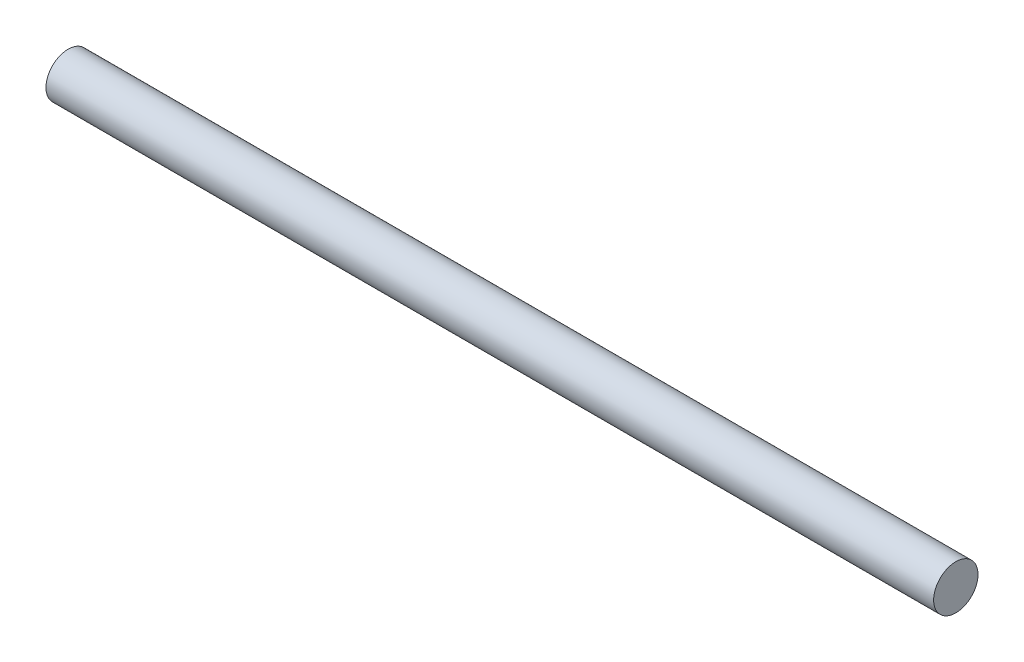
ISO-10303-21;
HEADER;
FILE_DESCRIPTION(('STEP AP214'),'2;1');
FILE_NAME('part.step','',(''),(''),'','','');
FILE_SCHEMA(('AUTOMOTIVE_DESIGN { 1 0 10303 214 1 1 1 1 }'));
ENDSEC;
DATA;
#1=APPLICATION_CONTEXT('core data for automotive mechanical design processes');
#2=APPLICATION_PROTOCOL_DEFINITION('international standard','automotive_design',2000,#1);
#3=PRODUCT_CONTEXT('',#1,'mechanical');
#4=PRODUCT('Part','Part','',(#3));
#5=PRODUCT_RELATED_PRODUCT_CATEGORY('part','',(#4));
#6=PRODUCT_DEFINITION_FORMATION('','',#4);
#7=PRODUCT_DEFINITION_CONTEXT('part definition',#1,'design');
#8=PRODUCT_DEFINITION('design','',#6,#7);
#9=PRODUCT_DEFINITION_SHAPE('','',#8);
#10=(LENGTH_UNIT() NAMED_UNIT(*) SI_UNIT(.MILLI.,.METRE.));
#11=(NAMED_UNIT(*) PLANE_ANGLE_UNIT() SI_UNIT($,.RADIAN.));
#12=(NAMED_UNIT(*) SI_UNIT($,.STERADIAN.) SOLID_ANGLE_UNIT());
#13=UNCERTAINTY_MEASURE_WITH_UNIT(LENGTH_MEASURE(1.E-05),#10,'distance_accuracy_value','');
#14=(GEOMETRIC_REPRESENTATION_CONTEXT(3) GLOBAL_UNCERTAINTY_ASSIGNED_CONTEXT((#13)) GLOBAL_UNIT_ASSIGNED_CONTEXT((#10,
#11,#12)) REPRESENTATION_CONTEXT('',''));
#15=CARTESIAN_POINT('',(0.,0.,0.));
#16=DIRECTION('',(0.,0.,1.));
#17=DIRECTION('',(1.,0.,0.));
#18=AXIS2_PLACEMENT_3D('',#15,#16,#17);
#19=CARTESIAN_POINT('',(40.,0.,0.));
#20=DIRECTION('',(-1.,0.,0.));
#21=DIRECTION('',(0.,0.,1.));
#22=AXIS2_PLACEMENT_3D('',#19,#20,#21);
#23=CYLINDRICAL_SURFACE('',#22,2.);
#24=CARTESIAN_POINT('',(40.,0.,0.));
#25=DIRECTION('',(1.,0.,0.));
#26=DIRECTION('',(0.,0.,-1.));
#27=AXIS2_PLACEMENT_3D('',#24,#25,#26);
#28=CIRCLE('',#27,2.);
#29=CARTESIAN_POINT('',(40.,0.,-2.));
#30=VERTEX_POINT('',#29);
#31=EDGE_CURVE('E10',#30,#30,#28,.T.);
#32=ORIENTED_EDGE('',*,*,#31,.F.);
#33=EDGE_LOOP('',(#32));
#34=FACE_BOUND('',#33,.T.);
#35=CARTESIAN_POINT('',(-40.,0.,0.));
#36=DIRECTION('',(1.,0.,0.));
#37=DIRECTION('',(0.,0.,-1.));
#38=AXIS2_PLACEMENT_3D('',#35,#36,#37);
#39=CIRCLE('',#38,2.);
#40=CARTESIAN_POINT('',(-40.,0.,-2.));
#41=VERTEX_POINT('',#40);
#42=EDGE_CURVE('E38',#41,#41,#39,.T.);
#43=ORIENTED_EDGE('',*,*,#42,.T.);
#44=EDGE_LOOP('',(#43));
#45=FACE_BOUND('',#44,.T.);
#46=ADVANCED_FACE('F35',(#34,#45),#23,.T.);
#47=CARTESIAN_POINT('',(40.,0.,0.));
#48=DIRECTION('',(1.,0.,0.));
#49=DIRECTION('',(0.,0.,-1.));
#50=AXIS2_PLACEMENT_3D('',#47,#48,#49);
#51=PLANE('',#50);
#52=ORIENTED_EDGE('',*,*,#31,.T.);
#53=EDGE_LOOP('',(#52));
#54=FACE_BOUND('',#53,.T.);
#55=ADVANCED_FACE('F50',(#54),#51,.T.);
#56=CARTESIAN_POINT('',(-40.,0.,0.));
#57=DIRECTION('',(1.,0.,0.));
#58=DIRECTION('',(0.,0.,-1.));
#59=AXIS2_PLACEMENT_3D('',#56,#57,#58);
#60=PLANE('',#59);
#61=ORIENTED_EDGE('',*,*,#42,.F.);
#62=EDGE_LOOP('',(#61));
#63=FACE_BOUND('',#62,.T.);
#64=ADVANCED_FACE('F48',(#63),#60,.F.);
#65=CLOSED_SHELL('',(#46,#55,#64));
#66=MANIFOLD_SOLID_BREP('B2',#65);
#67=ADVANCED_BREP_SHAPE_REPRESENTATION('',(#18,#66),#14);
#68=SHAPE_DEFINITION_REPRESENTATION(#9,#67);
ENDSEC;
END-ISO-10303-21;
